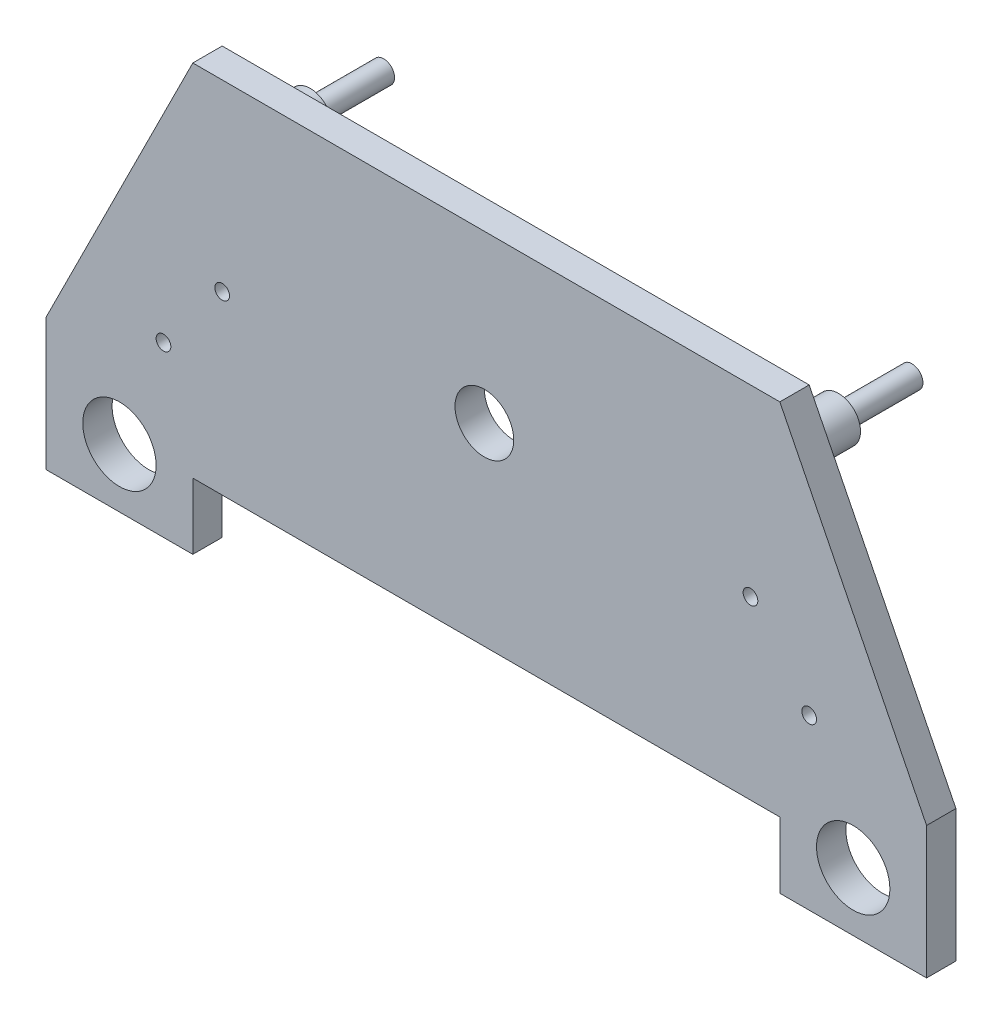
ISO-10303-21;
HEADER;
FILE_DESCRIPTION(('STEP AP214'),'2;1');
FILE_NAME('part.step','',(''),(''),'','','');
FILE_SCHEMA(('AUTOMOTIVE_DESIGN { 1 0 10303 214 1 1 1 1 }'));
ENDSEC;
DATA;
#1=APPLICATION_CONTEXT('core data for automotive mechanical design processes');
#2=APPLICATION_PROTOCOL_DEFINITION('international standard','automotive_design',2000,#1);
#3=PRODUCT_CONTEXT('',#1,'mechanical');
#4=PRODUCT('Part','Part','',(#3));
#5=PRODUCT_RELATED_PRODUCT_CATEGORY('part','',(#4));
#6=PRODUCT_DEFINITION_FORMATION('','',#4);
#7=PRODUCT_DEFINITION_CONTEXT('part definition',#1,'design');
#8=PRODUCT_DEFINITION('design','',#6,#7);
#9=PRODUCT_DEFINITION_SHAPE('','',#8);
#10=(LENGTH_UNIT() NAMED_UNIT(*) SI_UNIT(.MILLI.,.METRE.));
#11=(NAMED_UNIT(*) PLANE_ANGLE_UNIT() SI_UNIT($,.RADIAN.));
#12=(NAMED_UNIT(*) SI_UNIT($,.STERADIAN.) SOLID_ANGLE_UNIT());
#13=UNCERTAINTY_MEASURE_WITH_UNIT(LENGTH_MEASURE(1.E-05),#10,'distance_accuracy_value','');
#14=(GEOMETRIC_REPRESENTATION_CONTEXT(3) GLOBAL_UNCERTAINTY_ASSIGNED_CONTEXT((#13)) GLOBAL_UNIT_ASSIGNED_CONTEXT((#10,
#11,#12)) REPRESENTATION_CONTEXT('',''));
#15=CARTESIAN_POINT('',(0.,0.,0.));
#16=DIRECTION('',(0.,0.,1.));
#17=DIRECTION('',(1.,0.,0.));
#18=AXIS2_PLACEMENT_3D('',#15,#16,#17);
#19=CARTESIAN_POINT('',(-21.6856003226022,-18.8574385528918,2.));
#20=DIRECTION('',(-1.,0.,0.));
#21=DIRECTION('',(0.,0.,1.));
#22=AXIS2_PLACEMENT_3D('',#19,#20,#21);
#23=PLANE('',#22);
#24=DIRECTION('',(0.,0.,-1.));
#25=VECTOR('',#24,1.);
#26=CARTESIAN_POINT('',(-21.6856003226022,-14.3574385528918,2.));
#27=LINE('',#26,#25);
#28=CARTESIAN_POINT('',(-21.6856003226022,-14.3574385528918,2.));
#29=VERTEX_POINT('',#28);
#30=CARTESIAN_POINT('',(-21.6856003226022,-14.3574385528918,0.));
#31=VERTEX_POINT('',#30);
#32=EDGE_CURVE('E64',#29,#31,#27,.T.);
#33=ORIENTED_EDGE('',*,*,#32,.F.);
#34=DIRECTION('',(0.,1.,0.));
#35=VECTOR('',#34,1.);
#36=CARTESIAN_POINT('',(-21.6856003226022,-18.8574385528918,2.));
#37=LINE('',#36,#35);
#38=CARTESIAN_POINT('',(-21.6856003226022,-18.8574385528918,2.));
#39=VERTEX_POINT('',#38);
#40=EDGE_CURVE('E215',#39,#29,#37,.T.);
#41=ORIENTED_EDGE('',*,*,#40,.F.);
#42=DIRECTION('',(0.,0.,-1.));
#43=VECTOR('',#42,1.);
#44=CARTESIAN_POINT('',(-21.6856003226022,-18.8574385528918,2.));
#45=LINE('',#44,#43);
#46=CARTESIAN_POINT('',(-21.6856003226022,-18.8574385528918,0.));
#47=VERTEX_POINT('',#46);
#48=EDGE_CURVE('E150',#39,#47,#45,.T.);
#49=ORIENTED_EDGE('',*,*,#48,.T.);
#50=DIRECTION('',(0.,1.,0.));
#51=VECTOR('',#50,1.);
#52=CARTESIAN_POINT('',(-21.6856003226022,-18.8574385528918,0.));
#53=LINE('',#52,#51);
#54=EDGE_CURVE('E190',#47,#31,#53,.T.);
#55=ORIENTED_EDGE('',*,*,#54,.T.);
#56=EDGE_LOOP('',(#33,#41,#49,#55));
#57=FACE_BOUND('',#56,.T.);
#58=ADVANCED_FACE('F38',(#57),#23,.F.);
#59=CARTESIAN_POINT('',(18.3143996773978,-18.8574385528918,2.));
#60=DIRECTION('',(1.,0.,0.));
#61=DIRECTION('',(0.,0.,-1.));
#62=AXIS2_PLACEMENT_3D('',#59,#60,#61);
#63=PLANE('',#62);
#64=DIRECTION('',(0.,0.,-1.));
#65=VECTOR('',#64,1.);
#66=CARTESIAN_POINT('',(18.3143996773978,-14.3574385528918,2.));
#67=LINE('',#66,#65);
#68=CARTESIAN_POINT('',(18.3143996773978,-14.3574385528918,2.));
#69=VERTEX_POINT('',#68);
#70=CARTESIAN_POINT('',(18.3143996773978,-14.3574385528918,0.));
#71=VERTEX_POINT('',#70);
#72=EDGE_CURVE('E261',#69,#71,#67,.T.);
#73=ORIENTED_EDGE('',*,*,#72,.T.);
#74=DIRECTION('',(0.,-1.,0.));
#75=VECTOR('',#74,1.);
#76=CARTESIAN_POINT('',(18.3143996773978,-18.8574385528918,0.));
#77=LINE('',#76,#75);
#78=CARTESIAN_POINT('',(18.3143996773978,-18.8574385528918,0.));
#79=VERTEX_POINT('',#78);
#80=EDGE_CURVE('E187',#71,#79,#77,.T.);
#81=ORIENTED_EDGE('',*,*,#80,.T.);
#82=DIRECTION('',(0.,0.,-1.));
#83=VECTOR('',#82,1.);
#84=CARTESIAN_POINT('',(18.3143996773978,-18.8574385528918,2.));
#85=LINE('',#84,#83);
#86=CARTESIAN_POINT('',(18.3143996773978,-18.8574385528918,2.));
#87=VERTEX_POINT('',#86);
#88=EDGE_CURVE('E155',#87,#79,#85,.T.);
#89=ORIENTED_EDGE('',*,*,#88,.F.);
#90=DIRECTION('',(0.,-1.,0.));
#91=VECTOR('',#90,1.);
#92=CARTESIAN_POINT('',(18.3143996773978,-18.8574385528918,2.));
#93=LINE('',#92,#91);
#94=EDGE_CURVE('E56',#69,#87,#93,.T.);
#95=ORIENTED_EDGE('',*,*,#94,.F.);
#96=EDGE_LOOP('',(#73,#81,#89,#95));
#97=FACE_BOUND('',#96,.T.);
#98=ADVANCED_FACE('F350',(#97),#63,.F.);
#99=CARTESIAN_POINT('',(-31.6856003226022,-9.85743855289176,2.));
#100=DIRECTION('',(0.894427190999916,-0.447213595499958,0.));
#101=DIRECTION('',(0.447213595499958,0.894427190999916,0.));
#102=AXIS2_PLACEMENT_3D('',#99,#100,#101);
#103=PLANE('',#102);
#104=DIRECTION('',(-0.447213595499958,-0.894427190999916,0.));
#105=VECTOR('',#104,1.);
#106=CARTESIAN_POINT('',(-31.6856003226022,-9.85743855289176,0.));
#107=LINE('',#106,#105);
#108=CARTESIAN_POINT('',(-21.6856003226022,10.1425614471082,0.));
#109=VERTEX_POINT('',#108);
#110=CARTESIAN_POINT('',(-31.6856003226022,-9.85743855289176,0.));
#111=VERTEX_POINT('',#110);
#112=EDGE_CURVE('E144',#109,#111,#107,.T.);
#113=ORIENTED_EDGE('',*,*,#112,.T.);
#114=DIRECTION('',(0.,0.,-1.));
#115=VECTOR('',#114,1.);
#116=CARTESIAN_POINT('',(-31.6856003226022,-9.85743855289176,2.));
#117=LINE('',#116,#115);
#118=CARTESIAN_POINT('',(-31.6856003226022,-9.85743855289176,2.));
#119=VERTEX_POINT('',#118);
#120=EDGE_CURVE('E42',#119,#111,#117,.T.);
#121=ORIENTED_EDGE('',*,*,#120,.F.);
#122=DIRECTION('',(-0.447213595499958,-0.894427190999916,0.));
#123=VECTOR('',#122,1.);
#124=CARTESIAN_POINT('',(-31.6856003226022,-9.85743855289176,2.));
#125=LINE('',#124,#123);
#126=CARTESIAN_POINT('',(-21.6856003226022,10.1425614471082,2.));
#127=VERTEX_POINT('',#126);
#128=EDGE_CURVE('E130',#127,#119,#125,.T.);
#129=ORIENTED_EDGE('',*,*,#128,.F.);
#130=DIRECTION('',(0.,0.,-1.));
#131=VECTOR('',#130,1.);
#132=CARTESIAN_POINT('',(-21.6856003226022,10.1425614471082,2.));
#133=LINE('',#132,#131);
#134=EDGE_CURVE('E173',#127,#109,#133,.T.);
#135=ORIENTED_EDGE('',*,*,#134,.T.);
#136=EDGE_LOOP('',(#113,#121,#129,#135));
#137=FACE_BOUND('',#136,.T.);
#138=ADVANCED_FACE('F40',(#137),#103,.F.);
#139=CARTESIAN_POINT('',(-31.6856003226022,-9.85743855289176,2.));
#140=DIRECTION('',(1.,0.,0.));
#141=DIRECTION('',(0.,0.,-1.));
#142=AXIS2_PLACEMENT_3D('',#139,#140,#141);
#143=PLANE('',#142);
#144=DIRECTION('',(0.,-1.,0.));
#145=VECTOR('',#144,1.);
#146=CARTESIAN_POINT('',(-31.6856003226022,-9.85743855289176,0.));
#147=LINE('',#146,#145);
#148=CARTESIAN_POINT('',(-31.6856003226022,-18.8574385528918,0.));
#149=VERTEX_POINT('',#148);
#150=EDGE_CURVE('E196',#111,#149,#147,.T.);
#151=ORIENTED_EDGE('',*,*,#150,.T.);
#152=DIRECTION('',(0.,0.,-1.));
#153=VECTOR('',#152,1.);
#154=CARTESIAN_POINT('',(-31.6856003226022,-18.8574385528918,2.));
#155=LINE('',#154,#153);
#156=CARTESIAN_POINT('',(-31.6856003226022,-18.8574385528918,2.));
#157=VERTEX_POINT('',#156);
#158=EDGE_CURVE('E125',#157,#149,#155,.T.);
#159=ORIENTED_EDGE('',*,*,#158,.F.);
#160=DIRECTION('',(0.,-1.,0.));
#161=VECTOR('',#160,1.);
#162=CARTESIAN_POINT('',(-31.6856003226022,-9.85743855289176,2.));
#163=LINE('',#162,#161);
#164=EDGE_CURVE('E119',#119,#157,#163,.T.);
#165=ORIENTED_EDGE('',*,*,#164,.F.);
#166=ORIENTED_EDGE('',*,*,#120,.T.);
#167=EDGE_LOOP('',(#151,#159,#165,#166));
#168=FACE_BOUND('',#167,.T.);
#169=ADVANCED_FACE('F121',(#168),#143,.F.);
#170=CARTESIAN_POINT('',(-31.6856003226022,-18.8574385528918,2.));
#171=DIRECTION('',(0.,1.,0.));
#172=DIRECTION('',(0.,0.,1.));
#173=AXIS2_PLACEMENT_3D('',#170,#171,#172);
#174=PLANE('',#173);
#175=DIRECTION('',(1.,0.,0.));
#176=VECTOR('',#175,1.);
#177=CARTESIAN_POINT('',(-31.6856003226022,-18.8574385528918,0.));
#178=LINE('',#177,#176);
#179=EDGE_CURVE('E193',#149,#47,#178,.T.);
#180=ORIENTED_EDGE('',*,*,#179,.T.);
#181=ORIENTED_EDGE('',*,*,#48,.F.);
#182=DIRECTION('',(1.,0.,0.));
#183=VECTOR('',#182,1.);
#184=CARTESIAN_POINT('',(-31.6856003226022,-18.8574385528918,2.));
#185=LINE('',#184,#183);
#186=EDGE_CURVE('E129',#157,#39,#185,.T.);
#187=ORIENTED_EDGE('',*,*,#186,.F.);
#188=ORIENTED_EDGE('',*,*,#158,.T.);
#189=EDGE_LOOP('',(#180,#181,#187,#188));
#190=FACE_BOUND('',#189,.T.);
#191=ADVANCED_FACE('F358',(#190),#174,.F.);
#192=CARTESIAN_POINT('',(28.3143996773978,-18.8574385528918,2.));
#193=DIRECTION('',(0.,1.,0.));
#194=DIRECTION('',(0.,0.,1.));
#195=AXIS2_PLACEMENT_3D('',#192,#193,#194);
#196=PLANE('',#195);
#197=DIRECTION('',(1.,0.,0.));
#198=VECTOR('',#197,1.);
#199=CARTESIAN_POINT('',(28.3143996773978,-18.8574385528918,0.));
#200=LINE('',#199,#198);
#201=CARTESIAN_POINT('',(28.3143996773978,-18.8574385528918,0.));
#202=VERTEX_POINT('',#201);
#203=EDGE_CURVE('E184',#79,#202,#200,.T.);
#204=ORIENTED_EDGE('',*,*,#203,.T.);
#205=DIRECTION('',(0.,0.,-1.));
#206=VECTOR('',#205,1.);
#207=CARTESIAN_POINT('',(28.3143996773978,-18.8574385528918,2.));
#208=LINE('',#207,#206);
#209=CARTESIAN_POINT('',(28.3143996773978,-18.8574385528918,2.));
#210=VERTEX_POINT('',#209);
#211=EDGE_CURVE('E161',#210,#202,#208,.T.);
#212=ORIENTED_EDGE('',*,*,#211,.F.);
#213=DIRECTION('',(1.,0.,0.));
#214=VECTOR('',#213,1.);
#215=CARTESIAN_POINT('',(28.3143996773978,-18.8574385528918,2.));
#216=LINE('',#215,#214);
#217=EDGE_CURVE('E210',#87,#210,#216,.T.);
#218=ORIENTED_EDGE('',*,*,#217,.F.);
#219=ORIENTED_EDGE('',*,*,#88,.T.);
#220=EDGE_LOOP('',(#204,#212,#218,#219));
#221=FACE_BOUND('',#220,.T.);
#222=ADVANCED_FACE('F360',(#221),#196,.F.);
#223=CARTESIAN_POINT('',(28.3143996773978,-9.85743855289176,2.));
#224=DIRECTION('',(-1.,0.,0.));
#225=DIRECTION('',(0.,0.,1.));
#226=AXIS2_PLACEMENT_3D('',#223,#224,#225);
#227=PLANE('',#226);
#228=DIRECTION('',(0.,1.,0.));
#229=VECTOR('',#228,1.);
#230=CARTESIAN_POINT('',(28.3143996773978,-9.85743855289176,0.));
#231=LINE('',#230,#229);
#232=CARTESIAN_POINT('',(28.3143996773978,-9.85743855289176,0.));
#233=VERTEX_POINT('',#232);
#234=EDGE_CURVE('E181',#202,#233,#231,.T.);
#235=ORIENTED_EDGE('',*,*,#234,.T.);
#236=DIRECTION('',(0.,0.,-1.));
#237=VECTOR('',#236,1.);
#238=CARTESIAN_POINT('',(28.3143996773978,-9.85743855289176,2.));
#239=LINE('',#238,#237);
#240=CARTESIAN_POINT('',(28.3143996773978,-9.85743855289176,2.));
#241=VERTEX_POINT('',#240);
#242=EDGE_CURVE('E165',#241,#233,#239,.T.);
#243=ORIENTED_EDGE('',*,*,#242,.F.);
#244=DIRECTION('',(0.,1.,0.));
#245=VECTOR('',#244,1.);
#246=CARTESIAN_POINT('',(28.3143996773978,-9.85743855289176,2.));
#247=LINE('',#246,#245);
#248=EDGE_CURVE('E207',#210,#241,#247,.T.);
#249=ORIENTED_EDGE('',*,*,#248,.F.);
#250=ORIENTED_EDGE('',*,*,#211,.T.);
#251=EDGE_LOOP('',(#235,#243,#249,#250));
#252=FACE_BOUND('',#251,.T.);
#253=ADVANCED_FACE('F608',(#252),#227,.F.);
#254=CARTESIAN_POINT('',(28.3143996773978,-9.85743855289176,2.));
#255=DIRECTION('',(-0.894427190999916,-0.447213595499958,0.));
#256=DIRECTION('',(0.447213595499958,-0.894427190999916,0.));
#257=AXIS2_PLACEMENT_3D('',#254,#255,#256);
#258=PLANE('',#257);
#259=DIRECTION('',(-0.447213595499958,0.894427190999916,0.));
#260=VECTOR('',#259,1.);
#261=CARTESIAN_POINT('',(28.3143996773978,-9.85743855289176,0.));
#262=LINE('',#261,#260);
#263=CARTESIAN_POINT('',(18.3143996773978,10.1425614471082,0.));
#264=VERTEX_POINT('',#263);
#265=EDGE_CURVE('E178',#233,#264,#262,.T.);
#266=ORIENTED_EDGE('',*,*,#265,.T.);
#267=DIRECTION('',(0.,0.,-1.));
#268=VECTOR('',#267,1.);
#269=CARTESIAN_POINT('',(18.3143996773978,10.1425614471082,2.));
#270=LINE('',#269,#268);
#271=CARTESIAN_POINT('',(18.3143996773978,10.1425614471082,2.));
#272=VERTEX_POINT('',#271);
#273=EDGE_CURVE('E169',#272,#264,#270,.T.);
#274=ORIENTED_EDGE('',*,*,#273,.F.);
#275=DIRECTION('',(-0.447213595499958,0.894427190999916,0.));
#276=VECTOR('',#275,1.);
#277=CARTESIAN_POINT('',(28.3143996773978,-9.85743855289176,2.));
#278=LINE('',#277,#276);
#279=EDGE_CURVE('E204',#241,#272,#278,.T.);
#280=ORIENTED_EDGE('',*,*,#279,.F.);
#281=ORIENTED_EDGE('',*,*,#242,.T.);
#282=EDGE_LOOP('',(#266,#274,#280,#281));
#283=FACE_BOUND('',#282,.T.);
#284=ADVANCED_FACE('F598',(#283),#258,.F.);
#285=CARTESIAN_POINT('',(-21.6856003226022,10.1425614471082,2.));
#286=DIRECTION('',(0.,-1.,0.));
#287=DIRECTION('',(0.,0.,-1.));
#288=AXIS2_PLACEMENT_3D('',#285,#286,#287);
#289=PLANE('',#288);
#290=DIRECTION('',(-1.,0.,0.));
#291=VECTOR('',#290,1.);
#292=CARTESIAN_POINT('',(-21.6856003226022,10.1425614471082,0.));
#293=LINE('',#292,#291);
#294=EDGE_CURVE('E141',#264,#109,#293,.T.);
#295=ORIENTED_EDGE('',*,*,#294,.T.);
#296=ORIENTED_EDGE('',*,*,#134,.F.);
#297=DIRECTION('',(-1.,0.,0.));
#298=VECTOR('',#297,1.);
#299=CARTESIAN_POINT('',(-21.6856003226022,10.1425614471082,2.));
#300=LINE('',#299,#298);
#301=EDGE_CURVE('E136',#272,#127,#300,.T.);
#302=ORIENTED_EDGE('',*,*,#301,.F.);
#303=ORIENTED_EDGE('',*,*,#273,.T.);
#304=EDGE_LOOP('',(#295,#296,#302,#303));
#305=FACE_BOUND('',#304,.T.);
#306=ADVANCED_FACE('F477',(#305),#289,.F.);
#307=CARTESIAN_POINT('',(0.,0.,2.));
#308=DIRECTION('',(0.,0.,-1.));
#309=DIRECTION('',(-1.,0.,0.));
#310=AXIS2_PLACEMENT_3D('',#307,#308,#309);
#311=PLANE('',#310);
#312=CARTESIAN_POINT('',(-1.81808158679159,-1.1810834716367,2.));
#313=DIRECTION('',(0.,0.,-1.));
#314=DIRECTION('',(-1.,0.,0.));
#315=AXIS2_PLACEMENT_3D('',#312,#313,#314);
#316=CIRCLE('',#315,2.);
#317=CARTESIAN_POINT('',(-3.81808158679159,-1.1810834716367,2.));
#318=VERTEX_POINT('',#317);
#319=EDGE_CURVE('E294',#318,#318,#316,.T.);
#320=ORIENTED_EDGE('',*,*,#319,.T.);
#321=EDGE_LOOP('',(#320));
#322=FACE_BOUND('',#321,.T.);
#323=CARTESIAN_POINT('',(-23.6856003226022,-7.35743855289176,2.));
#324=DIRECTION('',(0.,0.,1.));
#325=DIRECTION('',(1.,0.,0.));
#326=AXIS2_PLACEMENT_3D('',#323,#324,#325);
#327=CIRCLE('',#326,0.499999999999999);
#328=CARTESIAN_POINT('',(-23.1856003226022,-7.35743855289176,2.));
#329=VERTEX_POINT('',#328);
#330=EDGE_CURVE('E289',#329,#329,#327,.T.);
#331=ORIENTED_EDGE('',*,*,#330,.F.);
#332=EDGE_LOOP('',(#331));
#333=FACE_BOUND('',#332,.T.);
#334=CARTESIAN_POINT('',(16.3143996773978,-2.35743855289176,2.));
#335=DIRECTION('',(0.,0.,1.));
#336=DIRECTION('',(1.,0.,0.));
#337=AXIS2_PLACEMENT_3D('',#334,#335,#336);
#338=CIRCLE('',#337,0.499999999999995);
#339=CARTESIAN_POINT('',(16.8143996773978,-2.35743855289176,2.));
#340=VERTEX_POINT('',#339);
#341=EDGE_CURVE('E290',#340,#340,#338,.T.);
#342=ORIENTED_EDGE('',*,*,#341,.F.);
#343=EDGE_LOOP('',(#342));
#344=FACE_BOUND('',#343,.T.);
#345=CARTESIAN_POINT('',(-19.6856003226022,-2.35743855289176,2.));
#346=DIRECTION('',(0.,0.,1.));
#347=DIRECTION('',(1.,0.,0.));
#348=AXIS2_PLACEMENT_3D('',#345,#346,#347);
#349=CIRCLE('',#348,0.499999999999999);
#350=CARTESIAN_POINT('',(-19.1856003226022,-2.35743855289176,2.));
#351=VERTEX_POINT('',#350);
#352=EDGE_CURVE('E272',#351,#351,#349,.T.);
#353=ORIENTED_EDGE('',*,*,#352,.F.);
#354=EDGE_LOOP('',(#353));
#355=FACE_BOUND('',#354,.T.);
#356=CARTESIAN_POINT('',(20.3143996773978,-7.35743855289176,2.));
#357=DIRECTION('',(0.,0.,1.));
#358=DIRECTION('',(1.,0.,0.));
#359=AXIS2_PLACEMENT_3D('',#356,#357,#358);
#360=CIRCLE('',#359,0.499999999999999);
#361=CARTESIAN_POINT('',(20.8143996773978,-7.35743855289176,2.));
#362=VERTEX_POINT('',#361);
#363=EDGE_CURVE('E281',#362,#362,#360,.T.);
#364=ORIENTED_EDGE('',*,*,#363,.F.);
#365=EDGE_LOOP('',(#364));
#366=FACE_BOUND('',#365,.T.);
#367=ORIENTED_EDGE('',*,*,#40,.T.);
#368=DIRECTION('',(1.,0.,0.));
#369=VECTOR('',#368,1.);
#370=CARTESIAN_POINT('',(18.3143996773978,-14.3574385528918,2.));
#371=LINE('',#370,#369);
#372=EDGE_CURVE('E264',#29,#69,#371,.T.);
#373=ORIENTED_EDGE('',*,*,#372,.T.);
#374=ORIENTED_EDGE('',*,*,#94,.T.);
#375=ORIENTED_EDGE('',*,*,#217,.T.);
#376=ORIENTED_EDGE('',*,*,#248,.T.);
#377=ORIENTED_EDGE('',*,*,#279,.T.);
#378=ORIENTED_EDGE('',*,*,#301,.T.);
#379=ORIENTED_EDGE('',*,*,#128,.T.);
#380=ORIENTED_EDGE('',*,*,#164,.T.);
#381=ORIENTED_EDGE('',*,*,#186,.T.);
#382=EDGE_LOOP('',(#367,#373,#374,#375,#376,#377,#378,#379,#380,#381));
#383=FACE_BOUND('',#382,.T.);
#384=CARTESIAN_POINT('',(-26.6856003226022,-14.8574385528918,2.));
#385=DIRECTION('',(0.,0.,1.));
#386=DIRECTION('',(1.,0.,0.));
#387=AXIS2_PLACEMENT_3D('',#384,#385,#386);
#388=CIRCLE('',#387,2.5);
#389=CARTESIAN_POINT('',(-24.1856003226022,-14.8574385528918,2.));
#390=VERTEX_POINT('',#389);
#391=EDGE_CURVE('E201',#390,#390,#388,.T.);
#392=ORIENTED_EDGE('',*,*,#391,.F.);
#393=EDGE_LOOP('',(#392));
#394=FACE_BOUND('',#393,.T.);
#395=CARTESIAN_POINT('',(23.3143996773978,-14.8574385528918,2.));
#396=DIRECTION('',(0.,0.,1.));
#397=DIRECTION('',(1.,0.,0.));
#398=AXIS2_PLACEMENT_3D('',#395,#396,#397);
#399=CIRCLE('',#398,2.5);
#400=CARTESIAN_POINT('',(25.8143996773978,-14.8574385528918,2.));
#401=VERTEX_POINT('',#400);
#402=EDGE_CURVE('E224',#401,#401,#399,.T.);
#403=ORIENTED_EDGE('',*,*,#402,.F.);
#404=EDGE_LOOP('',(#403));
#405=FACE_BOUND('',#404,.T.);
#406=ADVANCED_FACE('F133',(#322,#333,#344,#355,#366,#383,#394,#405),#311,.F.);
#407=CARTESIAN_POINT('',(0.,0.,0.));
#408=DIRECTION('',(0.,0.,-1.));
#409=DIRECTION('',(-1.,0.,0.));
#410=AXIS2_PLACEMENT_3D('',#407,#408,#409);
#411=PLANE('',#410);
#412=CARTESIAN_POINT('',(-1.81808158679159,-1.1810834716367,0.));
#413=DIRECTION('',(0.,0.,-1.));
#414=DIRECTION('',(-1.,0.,0.));
#415=AXIS2_PLACEMENT_3D('',#412,#413,#414);
#416=CIRCLE('',#415,2.);
#417=CARTESIAN_POINT('',(-3.81808158679159,-1.1810834716367,0.));
#418=VERTEX_POINT('',#417);
#419=EDGE_CURVE('E304',#418,#418,#416,.T.);
#420=ORIENTED_EDGE('',*,*,#419,.F.);
#421=EDGE_LOOP('',(#420));
#422=FACE_BOUND('',#421,.T.);
#423=DIRECTION('',(1.,0.,0.));
#424=VECTOR('',#423,1.);
#425=CARTESIAN_POINT('',(18.3143996773978,-14.3574385528918,0.));
#426=LINE('',#425,#424);
#427=EDGE_CURVE('E265',#31,#71,#426,.T.);
#428=ORIENTED_EDGE('',*,*,#427,.F.);
#429=ORIENTED_EDGE('',*,*,#54,.F.);
#430=ORIENTED_EDGE('',*,*,#179,.F.);
#431=ORIENTED_EDGE('',*,*,#150,.F.);
#432=ORIENTED_EDGE('',*,*,#112,.F.);
#433=ORIENTED_EDGE('',*,*,#294,.F.);
#434=ORIENTED_EDGE('',*,*,#265,.F.);
#435=ORIENTED_EDGE('',*,*,#234,.F.);
#436=ORIENTED_EDGE('',*,*,#203,.F.);
#437=ORIENTED_EDGE('',*,*,#80,.F.);
#438=EDGE_LOOP('',(#428,#429,#430,#431,#432,#433,#434,#435,#436,#437));
#439=FACE_BOUND('',#438,.T.);
#440=CARTESIAN_POINT('',(-19.6856003226022,5.14256144710824,0.));
#441=DIRECTION('',(0.,0.,-1.));
#442=DIRECTION('',(-1.,0.,0.));
#443=AXIS2_PLACEMENT_3D('',#440,#441,#442);
#444=CIRCLE('',#443,1.5);
#445=CARTESIAN_POINT('',(-21.1856003226022,5.14256144710824,0.));
#446=VERTEX_POINT('',#445);
#447=EDGE_CURVE('E244',#446,#446,#444,.T.);
#448=ORIENTED_EDGE('',*,*,#447,.F.);
#449=EDGE_LOOP('',(#448));
#450=FACE_BOUND('',#449,.T.);
#451=CARTESIAN_POINT('',(16.3143996773978,5.14256144710823,0.));
#452=DIRECTION('',(0.,0.,-1.));
#453=DIRECTION('',(-1.,0.,0.));
#454=AXIS2_PLACEMENT_3D('',#451,#452,#453);
#455=CIRCLE('',#454,1.5);
#456=CARTESIAN_POINT('',(14.8143996773978,5.14256144710823,0.));
#457=VERTEX_POINT('',#456);
#458=EDGE_CURVE('E236',#457,#457,#455,.T.);
#459=ORIENTED_EDGE('',*,*,#458,.F.);
#460=EDGE_LOOP('',(#459));
#461=FACE_BOUND('',#460,.T.);
#462=CARTESIAN_POINT('',(-26.6856003226022,-14.8574385528918,0.));
#463=DIRECTION('',(0.,0.,1.));
#464=DIRECTION('',(1.,0.,0.));
#465=AXIS2_PLACEMENT_3D('',#462,#463,#464);
#466=CIRCLE('',#465,2.5);
#467=CARTESIAN_POINT('',(-24.1856003226022,-14.8574385528918,0.));
#468=VERTEX_POINT('',#467);
#469=EDGE_CURVE('E229',#468,#468,#466,.T.);
#470=ORIENTED_EDGE('',*,*,#469,.T.);
#471=EDGE_LOOP('',(#470));
#472=FACE_BOUND('',#471,.T.);
#473=CARTESIAN_POINT('',(23.3143996773978,-14.8574385528918,0.));
#474=DIRECTION('',(0.,0.,1.));
#475=DIRECTION('',(1.,0.,0.));
#476=AXIS2_PLACEMENT_3D('',#473,#474,#475);
#477=CIRCLE('',#476,2.5);
#478=CARTESIAN_POINT('',(25.8143996773978,-14.8574385528918,0.));
#479=VERTEX_POINT('',#478);
#480=EDGE_CURVE('E220',#479,#479,#477,.T.);
#481=ORIENTED_EDGE('',*,*,#480,.T.);
#482=EDGE_LOOP('',(#481));
#483=FACE_BOUND('',#482,.T.);
#484=ADVANCED_FACE('F321',(#422,#439,#450,#461,#472,#483),#411,.T.);
#485=CARTESIAN_POINT('',(23.3143996773978,-14.8574385528918,2.));
#486=DIRECTION('',(0.,0.,-1.));
#487=DIRECTION('',(-1.,0.,0.));
#488=AXIS2_PLACEMENT_3D('',#485,#486,#487);
#489=CYLINDRICAL_SURFACE('',#488,2.5);
#490=ORIENTED_EDGE('',*,*,#402,.T.);
#491=EDGE_LOOP('',(#490));
#492=FACE_BOUND('',#491,.T.);
#493=ORIENTED_EDGE('',*,*,#480,.F.);
#494=EDGE_LOOP('',(#493));
#495=FACE_BOUND('',#494,.T.);
#496=ADVANCED_FACE('F324',(#492,#495),#489,.F.);
#497=CARTESIAN_POINT('',(-26.6856003226022,-14.8574385528918,2.));
#498=DIRECTION('',(0.,0.,-1.));
#499=DIRECTION('',(-1.,0.,0.));
#500=AXIS2_PLACEMENT_3D('',#497,#498,#499);
#501=CYLINDRICAL_SURFACE('',#500,2.5);
#502=ORIENTED_EDGE('',*,*,#391,.T.);
#503=EDGE_LOOP('',(#502));
#504=FACE_BOUND('',#503,.T.);
#505=ORIENTED_EDGE('',*,*,#469,.F.);
#506=EDGE_LOOP('',(#505));
#507=FACE_BOUND('',#506,.T.);
#508=ADVANCED_FACE('F339',(#504,#507),#501,.F.);
#509=CARTESIAN_POINT('',(16.3143996773978,5.14256144710823,-4.));
#510=DIRECTION('',(0.,0.,1.));
#511=DIRECTION('',(1.,0.,0.));
#512=AXIS2_PLACEMENT_3D('',#509,#510,#511);
#513=CYLINDRICAL_SURFACE('',#512,1.5);
#514=CARTESIAN_POINT('',(16.3143996773978,5.14256144710823,-4.));
#515=DIRECTION('',(0.,0.,-1.));
#516=DIRECTION('',(-1.,0.,0.));
#517=AXIS2_PLACEMENT_3D('',#514,#515,#516);
#518=CIRCLE('',#517,1.5);
#519=CARTESIAN_POINT('',(14.8143996773978,5.14256144710823,-4.));
#520=VERTEX_POINT('',#519);
#521=EDGE_CURVE('E225',#520,#520,#518,.T.);
#522=ORIENTED_EDGE('',*,*,#521,.F.);
#523=EDGE_LOOP('',(#522));
#524=FACE_BOUND('',#523,.T.);
#525=ORIENTED_EDGE('',*,*,#458,.T.);
#526=EDGE_LOOP('',(#525));
#527=FACE_BOUND('',#526,.T.);
#528=ADVANCED_FACE('F345',(#524,#527),#513,.T.);
#529=CARTESIAN_POINT('',(16.3143996773978,5.14256144710823,-4.));
#530=DIRECTION('',(0.,0.,-1.));
#531=DIRECTION('',(-1.,0.,0.));
#532=AXIS2_PLACEMENT_3D('',#529,#530,#531);
#533=PLANE('',#532);
#534=CARTESIAN_POINT('',(16.3143996773978,5.14256144710823,-4.));
#535=DIRECTION('',(0.,0.,-1.));
#536=DIRECTION('',(-1.,0.,0.));
#537=AXIS2_PLACEMENT_3D('',#534,#535,#536);
#538=CIRCLE('',#537,0.75);
#539=CARTESIAN_POINT('',(15.5643996773978,5.14256144710823,-4.));
#540=VERTEX_POINT('',#539);
#541=EDGE_CURVE('E48',#540,#540,#538,.T.);
#542=ORIENTED_EDGE('',*,*,#541,.F.);
#543=EDGE_LOOP('',(#542));
#544=FACE_BOUND('',#543,.T.);
#545=ORIENTED_EDGE('',*,*,#521,.T.);
#546=EDGE_LOOP('',(#545));
#547=FACE_BOUND('',#546,.T.);
#548=ADVANCED_FACE('F514',(#544,#547),#533,.T.);
#549=CARTESIAN_POINT('',(-19.6856003226022,5.14256144710824,-4.));
#550=DIRECTION('',(0.,0.,1.));
#551=DIRECTION('',(1.,0.,0.));
#552=AXIS2_PLACEMENT_3D('',#549,#550,#551);
#553=CYLINDRICAL_SURFACE('',#552,1.5);
#554=CARTESIAN_POINT('',(-19.6856003226022,5.14256144710824,-4.));
#555=DIRECTION('',(0.,0.,-1.));
#556=DIRECTION('',(-1.,0.,0.));
#557=AXIS2_PLACEMENT_3D('',#554,#555,#556);
#558=CIRCLE('',#557,1.5);
#559=CARTESIAN_POINT('',(-21.1856003226022,5.14256144710824,-4.));
#560=VERTEX_POINT('',#559);
#561=EDGE_CURVE('E240',#560,#560,#558,.T.);
#562=ORIENTED_EDGE('',*,*,#561,.F.);
#563=EDGE_LOOP('',(#562));
#564=FACE_BOUND('',#563,.T.);
#565=ORIENTED_EDGE('',*,*,#447,.T.);
#566=EDGE_LOOP('',(#565));
#567=FACE_BOUND('',#566,.T.);
#568=ADVANCED_FACE('F524',(#564,#567),#553,.T.);
#569=CARTESIAN_POINT('',(-19.6856003226022,5.14256144710824,-4.));
#570=DIRECTION('',(0.,0.,-1.));
#571=DIRECTION('',(-1.,0.,0.));
#572=AXIS2_PLACEMENT_3D('',#569,#570,#571);
#573=PLANE('',#572);
#574=CARTESIAN_POINT('',(-19.6856003226022,5.14256144710824,-4.));
#575=DIRECTION('',(0.,0.,-1.));
#576=DIRECTION('',(-1.,0.,0.));
#577=AXIS2_PLACEMENT_3D('',#574,#575,#576);
#578=CIRCLE('',#577,0.750000000000002);
#579=CARTESIAN_POINT('',(-20.4356003226022,5.14256144710824,-4.));
#580=VERTEX_POINT('',#579);
#581=EDGE_CURVE('E11',#580,#580,#578,.T.);
#582=ORIENTED_EDGE('',*,*,#581,.F.);
#583=EDGE_LOOP('',(#582));
#584=FACE_BOUND('',#583,.T.);
#585=ORIENTED_EDGE('',*,*,#561,.T.);
#586=EDGE_LOOP('',(#585));
#587=FACE_BOUND('',#586,.T.);
#588=ADVANCED_FACE('F533',(#584,#587),#573,.T.);
#589=CARTESIAN_POINT('',(16.3143996773978,5.14256144710823,-9.));
#590=DIRECTION('',(0.,0.,1.));
#591=DIRECTION('',(1.,0.,0.));
#592=AXIS2_PLACEMENT_3D('',#589,#590,#591);
#593=CYLINDRICAL_SURFACE('',#592,0.75);
#594=CARTESIAN_POINT('',(16.3143996773978,5.14256144710823,-9.));
#595=DIRECTION('',(0.,0.,-1.));
#596=DIRECTION('',(-1.,0.,0.));
#597=AXIS2_PLACEMENT_3D('',#594,#595,#596);
#598=CIRCLE('',#597,0.75);
#599=CARTESIAN_POINT('',(15.5643996773978,5.14256144710823,-9.));
#600=VERTEX_POINT('',#599);
#601=EDGE_CURVE('E248',#600,#600,#598,.T.);
#602=ORIENTED_EDGE('',*,*,#601,.F.);
#603=EDGE_LOOP('',(#602));
#604=FACE_BOUND('',#603,.T.);
#605=ORIENTED_EDGE('',*,*,#541,.T.);
#606=EDGE_LOOP('',(#605));
#607=FACE_BOUND('',#606,.T.);
#608=ADVANCED_FACE('F541',(#604,#607),#593,.T.);
#609=CARTESIAN_POINT('',(16.3143996773978,5.14256144710823,-9.));
#610=DIRECTION('',(0.,0.,-1.));
#611=DIRECTION('',(-1.,0.,0.));
#612=AXIS2_PLACEMENT_3D('',#609,#610,#611);
#613=PLANE('',#612);
#614=ORIENTED_EDGE('',*,*,#601,.T.);
#615=EDGE_LOOP('',(#614));
#616=FACE_BOUND('',#615,.T.);
#617=ADVANCED_FACE('F550',(#616),#613,.T.);
#618=CARTESIAN_POINT('',(-19.6856003226022,5.14256144710824,-9.));
#619=DIRECTION('',(0.,0.,1.));
#620=DIRECTION('',(1.,0.,0.));
#621=AXIS2_PLACEMENT_3D('',#618,#619,#620);
#622=CYLINDRICAL_SURFACE('',#621,0.750000000000002);
#623=CARTESIAN_POINT('',(-19.6856003226022,5.14256144710824,-9.));
#624=DIRECTION('',(0.,0.,-1.));
#625=DIRECTION('',(-1.,0.,0.));
#626=AXIS2_PLACEMENT_3D('',#623,#624,#625);
#627=CIRCLE('',#626,0.750000000000002);
#628=CARTESIAN_POINT('',(-20.4356003226022,5.14256144710824,-9.));
#629=VERTEX_POINT('',#628);
#630=EDGE_CURVE('E254',#629,#629,#627,.T.);
#631=ORIENTED_EDGE('',*,*,#630,.F.);
#632=EDGE_LOOP('',(#631));
#633=FACE_BOUND('',#632,.T.);
#634=ORIENTED_EDGE('',*,*,#581,.T.);
#635=EDGE_LOOP('',(#634));
#636=FACE_BOUND('',#635,.T.);
#637=ADVANCED_FACE('F559',(#633,#636),#622,.T.);
#638=CARTESIAN_POINT('',(-19.6856003226022,5.14256144710824,-9.));
#639=DIRECTION('',(0.,0.,-1.));
#640=DIRECTION('',(-1.,0.,0.));
#641=AXIS2_PLACEMENT_3D('',#638,#639,#640);
#642=PLANE('',#641);
#643=ORIENTED_EDGE('',*,*,#630,.T.);
#644=EDGE_LOOP('',(#643));
#645=FACE_BOUND('',#644,.T.);
#646=ADVANCED_FACE('F386',(#645),#642,.T.);
#647=CARTESIAN_POINT('',(18.3143996773978,-14.3574385528918,2.));
#648=DIRECTION('',(0.,1.,0.));
#649=DIRECTION('',(-1.,0.,0.));
#650=AXIS2_PLACEMENT_3D('',#647,#648,#649);
#651=PLANE('',#650);
#652=ORIENTED_EDGE('',*,*,#427,.T.);
#653=ORIENTED_EDGE('',*,*,#72,.F.);
#654=ORIENTED_EDGE('',*,*,#372,.F.);
#655=ORIENTED_EDGE('',*,*,#32,.T.);
#656=EDGE_LOOP('',(#652,#653,#654,#655));
#657=FACE_BOUND('',#656,.T.);
#658=ADVANCED_FACE('F380',(#657),#651,.F.);
#659=CARTESIAN_POINT('',(20.3143996773978,-7.35743855289176,1.));
#660=DIRECTION('',(0.,0.,1.));
#661=DIRECTION('',(1.,0.,0.));
#662=AXIS2_PLACEMENT_3D('',#659,#660,#661);
#663=CYLINDRICAL_SURFACE('',#662,0.499999999999999);
#664=CARTESIAN_POINT('',(20.3143996773978,-7.35743855289176,1.));
#665=DIRECTION('',(0.,0.,1.));
#666=DIRECTION('',(1.,0.,0.));
#667=AXIS2_PLACEMENT_3D('',#664,#665,#666);
#668=CIRCLE('',#667,0.499999999999999);
#669=CARTESIAN_POINT('',(20.8143996773978,-7.35743855289176,1.));
#670=VERTEX_POINT('',#669);
#671=EDGE_CURVE('E285',#670,#670,#668,.T.);
#672=ORIENTED_EDGE('',*,*,#671,.F.);
#673=EDGE_LOOP('',(#672));
#674=FACE_BOUND('',#673,.T.);
#675=ORIENTED_EDGE('',*,*,#363,.T.);
#676=EDGE_LOOP('',(#675));
#677=FACE_BOUND('',#676,.T.);
#678=ADVANCED_FACE('F385',(#674,#677),#663,.F.);
#679=CARTESIAN_POINT('',(20.3143996773978,-7.35743855289176,1.));
#680=DIRECTION('',(0.,0.,1.));
#681=DIRECTION('',(1.,0.,0.));
#682=AXIS2_PLACEMENT_3D('',#679,#680,#681);
#683=PLANE('',#682);
#684=ORIENTED_EDGE('',*,*,#671,.T.);
#685=EDGE_LOOP('',(#684));
#686=FACE_BOUND('',#685,.T.);
#687=ADVANCED_FACE('F398',(#686),#683,.T.);
#688=CARTESIAN_POINT('',(-19.6856003226022,-2.35743855289176,1.));
#689=DIRECTION('',(0.,0.,1.));
#690=DIRECTION('',(1.,0.,0.));
#691=AXIS2_PLACEMENT_3D('',#688,#689,#690);
#692=CYLINDRICAL_SURFACE('',#691,0.499999999999999);
#693=CARTESIAN_POINT('',(-19.6856003226022,-2.35743855289176,1.));
#694=DIRECTION('',(0.,0.,1.));
#695=DIRECTION('',(1.,0.,0.));
#696=AXIS2_PLACEMENT_3D('',#693,#694,#695);
#697=CIRCLE('',#696,0.499999999999999);
#698=CARTESIAN_POINT('',(-19.1856003226022,-2.35743855289176,1.));
#699=VERTEX_POINT('',#698);
#700=EDGE_CURVE('E276',#699,#699,#697,.T.);
#701=ORIENTED_EDGE('',*,*,#700,.F.);
#702=EDGE_LOOP('',(#701));
#703=FACE_BOUND('',#702,.T.);
#704=ORIENTED_EDGE('',*,*,#352,.T.);
#705=EDGE_LOOP('',(#704));
#706=FACE_BOUND('',#705,.T.);
#707=ADVANCED_FACE('F408',(#703,#706),#692,.F.);
#708=CARTESIAN_POINT('',(-19.6856003226022,-2.35743855289176,1.));
#709=DIRECTION('',(0.,0.,1.));
#710=DIRECTION('',(1.,0.,0.));
#711=AXIS2_PLACEMENT_3D('',#708,#709,#710);
#712=PLANE('',#711);
#713=ORIENTED_EDGE('',*,*,#700,.T.);
#714=EDGE_LOOP('',(#713));
#715=FACE_BOUND('',#714,.T.);
#716=ADVANCED_FACE('F418',(#715),#712,.T.);
#717=CARTESIAN_POINT('',(16.3143996773978,-2.35743855289176,1.));
#718=DIRECTION('',(0.,0.,1.));
#719=DIRECTION('',(1.,0.,0.));
#720=AXIS2_PLACEMENT_3D('',#717,#718,#719);
#721=CYLINDRICAL_SURFACE('',#720,0.499999999999995);
#722=CARTESIAN_POINT('',(16.3143996773978,-2.35743855289176,1.));
#723=DIRECTION('',(0.,0.,1.));
#724=DIRECTION('',(1.,0.,0.));
#725=AXIS2_PLACEMENT_3D('',#722,#723,#724);
#726=CIRCLE('',#725,0.499999999999995);
#727=CARTESIAN_POINT('',(16.8143996773978,-2.35743855289176,1.));
#728=VERTEX_POINT('',#727);
#729=EDGE_CURVE('E277',#728,#728,#726,.T.);
#730=ORIENTED_EDGE('',*,*,#729,.F.);
#731=EDGE_LOOP('',(#730));
#732=FACE_BOUND('',#731,.T.);
#733=ORIENTED_EDGE('',*,*,#341,.T.);
#734=EDGE_LOOP('',(#733));
#735=FACE_BOUND('',#734,.T.);
#736=ADVANCED_FACE('F428',(#732,#735),#721,.F.);
#737=CARTESIAN_POINT('',(16.3143996773978,-2.35743855289176,1.));
#738=DIRECTION('',(0.,0.,1.));
#739=DIRECTION('',(1.,0.,0.));
#740=AXIS2_PLACEMENT_3D('',#737,#738,#739);
#741=PLANE('',#740);
#742=ORIENTED_EDGE('',*,*,#729,.T.);
#743=EDGE_LOOP('',(#742));
#744=FACE_BOUND('',#743,.T.);
#745=ADVANCED_FACE('F438',(#744),#741,.T.);
#746=CARTESIAN_POINT('',(-23.6856003226022,-7.35743855289176,1.));
#747=DIRECTION('',(0.,0.,1.));
#748=DIRECTION('',(1.,0.,0.));
#749=AXIS2_PLACEMENT_3D('',#746,#747,#748);
#750=CYLINDRICAL_SURFACE('',#749,0.499999999999999);
#751=CARTESIAN_POINT('',(-23.6856003226022,-7.35743855289176,1.));
#752=DIRECTION('',(0.,0.,1.));
#753=DIRECTION('',(1.,0.,0.));
#754=AXIS2_PLACEMENT_3D('',#751,#752,#753);
#755=CIRCLE('',#754,0.499999999999999);
#756=CARTESIAN_POINT('',(-23.1856003226022,-7.35743855289176,1.));
#757=VERTEX_POINT('',#756);
#758=EDGE_CURVE('E269',#757,#757,#755,.T.);
#759=ORIENTED_EDGE('',*,*,#758,.F.);
#760=EDGE_LOOP('',(#759));
#761=FACE_BOUND('',#760,.T.);
#762=ORIENTED_EDGE('',*,*,#330,.T.);
#763=EDGE_LOOP('',(#762));
#764=FACE_BOUND('',#763,.T.);
#765=ADVANCED_FACE('F448',(#761,#764),#750,.F.);
#766=CARTESIAN_POINT('',(-23.6856003226022,-7.35743855289176,1.));
#767=DIRECTION('',(0.,0.,1.));
#768=DIRECTION('',(1.,0.,0.));
#769=AXIS2_PLACEMENT_3D('',#766,#767,#768);
#770=PLANE('',#769);
#771=ORIENTED_EDGE('',*,*,#758,.T.);
#772=EDGE_LOOP('',(#771));
#773=FACE_BOUND('',#772,.T.);
#774=ADVANCED_FACE('F317',(#773),#770,.T.);
#775=CARTESIAN_POINT('',(-1.81808158679159,-1.1810834716367,2.));
#776=DIRECTION('',(0.,0.,-1.));
#777=DIRECTION('',(-1.,0.,0.));
#778=AXIS2_PLACEMENT_3D('',#775,#776,#777);
#779=CYLINDRICAL_SURFACE('',#778,2.);
#780=ORIENTED_EDGE('',*,*,#319,.F.);
#781=EDGE_LOOP('',(#780));
#782=FACE_BOUND('',#781,.T.);
#783=ORIENTED_EDGE('',*,*,#419,.T.);
#784=EDGE_LOOP('',(#783));
#785=FACE_BOUND('',#784,.T.);
#786=ADVANCED_FACE('F314',(#782,#785),#779,.F.);
#787=CLOSED_SHELL('',(#58,#98,#138,#169,#191,#222,#253,#284,#306,#406,#484,#496,#508,#528,#548,
#568,#588,#608,#617,#637,#646,#658,#678,#687,#707,#716,#736,#745,#765,#774,#786));
#788=MANIFOLD_SOLID_BREP('B2',#787);
#789=ADVANCED_BREP_SHAPE_REPRESENTATION('',(#18,#788),#14);
#790=SHAPE_DEFINITION_REPRESENTATION(#9,#789);
ENDSEC;
END-ISO-10303-21;
